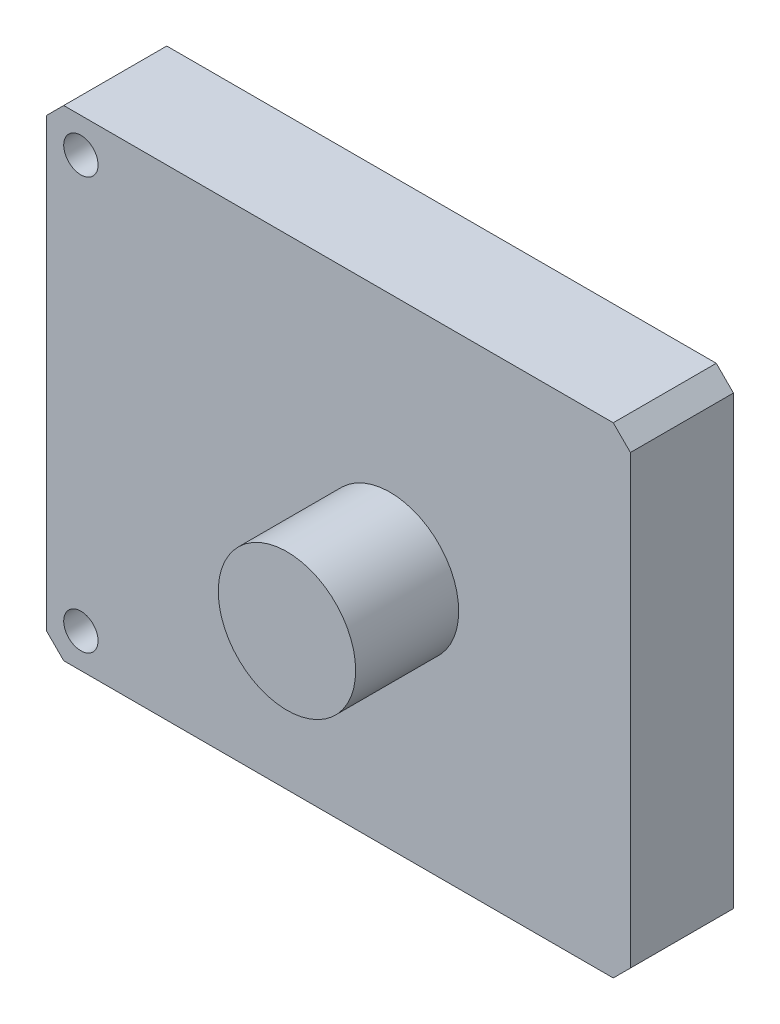
ISO-10303-21;
HEADER;
FILE_DESCRIPTION(('STEP AP214'),'2;1');
FILE_NAME('part.step','',(''),(''),'','','');
FILE_SCHEMA(('AUTOMOTIVE_DESIGN { 1 0 10303 214 1 1 1 1 }'));
ENDSEC;
DATA;
#1=APPLICATION_CONTEXT('core data for automotive mechanical design processes');
#2=APPLICATION_PROTOCOL_DEFINITION('international standard','automotive_design',2000,#1);
#3=PRODUCT_CONTEXT('',#1,'mechanical');
#4=PRODUCT('Part','Part','',(#3));
#5=PRODUCT_RELATED_PRODUCT_CATEGORY('part','',(#4));
#6=PRODUCT_DEFINITION_FORMATION('','',#4);
#7=PRODUCT_DEFINITION_CONTEXT('part definition',#1,'design');
#8=PRODUCT_DEFINITION('design','',#6,#7);
#9=PRODUCT_DEFINITION_SHAPE('','',#8);
#10=(LENGTH_UNIT() NAMED_UNIT(*) SI_UNIT(.MILLI.,.METRE.));
#11=(NAMED_UNIT(*) PLANE_ANGLE_UNIT() SI_UNIT($,.RADIAN.));
#12=(NAMED_UNIT(*) SI_UNIT($,.STERADIAN.) SOLID_ANGLE_UNIT());
#13=UNCERTAINTY_MEASURE_WITH_UNIT(LENGTH_MEASURE(1.E-05),#10,'distance_accuracy_value','');
#14=(GEOMETRIC_REPRESENTATION_CONTEXT(3) GLOBAL_UNCERTAINTY_ASSIGNED_CONTEXT((#13)) GLOBAL_UNIT_ASSIGNED_CONTEXT((#10,
#11,#12)) REPRESENTATION_CONTEXT('',''));
#15=CARTESIAN_POINT('',(0.,0.,0.));
#16=DIRECTION('',(0.,0.,1.));
#17=DIRECTION('',(1.,0.,0.));
#18=AXIS2_PLACEMENT_3D('',#15,#16,#17);
#19=CARTESIAN_POINT('',(0.,0.,30.));
#20=DIRECTION('',(0.,0.,1.));
#21=DIRECTION('',(1.,0.,0.));
#22=AXIS2_PLACEMENT_3D('',#19,#20,#21);
#23=PLANE('',#22);
#24=CARTESIAN_POINT('',(-75.,-60.,30.));
#25=DIRECTION('',(0.,0.,1.));
#26=DIRECTION('',(1.,0.,0.));
#27=AXIS2_PLACEMENT_3D('',#24,#25,#26);
#28=CIRCLE('',#27,5.00000000000001);
#29=CARTESIAN_POINT('',(-70.,-60.,30.));
#30=VERTEX_POINT('',#29);
#31=EDGE_CURVE('E191',#30,#30,#28,.F.);
#32=ORIENTED_EDGE('',*,*,#31,.T.);
#33=EDGE_LOOP('',(#32));
#34=FACE_BOUND('',#33,.T.);
#35=CARTESIAN_POINT('',(15.,0.,30.));
#36=DIRECTION('',(0.,0.,1.));
#37=DIRECTION('',(1.,0.,0.));
#38=AXIS2_PLACEMENT_3D('',#35,#36,#37);
#39=CIRCLE('',#38,20.);
#40=CARTESIAN_POINT('',(35.,0.,30.));
#41=VERTEX_POINT('',#40);
#42=EDGE_CURVE('E182',#41,#41,#39,.T.);
#43=ORIENTED_EDGE('',*,*,#42,.F.);
#44=EDGE_LOOP('',(#43));
#45=FACE_BOUND('',#44,.T.);
#46=DIRECTION('',(-1.,0.,0.));
#47=VECTOR('',#46,1.);
#48=CARTESIAN_POINT('',(-85.,70.,30.));
#49=LINE('',#48,#47);
#50=CARTESIAN_POINT('',(80.,70.,30.));
#51=VERTEX_POINT('',#50);
#52=CARTESIAN_POINT('',(-80.,70.,30.));
#53=VERTEX_POINT('',#52);
#54=EDGE_CURVE('E175',#51,#53,#49,.T.);
#55=ORIENTED_EDGE('',*,*,#54,.T.);
#56=DIRECTION('',(0.707106781186548,0.707106781186548,0.));
#57=VECTOR('',#56,1.);
#58=CARTESIAN_POINT('',(-75.,75.,30.));
#59=LINE('',#58,#57);
#60=CARTESIAN_POINT('',(-85.,64.9999999999999,30.));
#61=VERTEX_POINT('',#60);
#62=EDGE_CURVE('E156',#53,#61,#59,.F.);
#63=ORIENTED_EDGE('',*,*,#62,.T.);
#64=DIRECTION('',(0.,-1.,0.));
#65=VECTOR('',#64,1.);
#66=CARTESIAN_POINT('',(-85.,70.,30.));
#67=LINE('',#66,#65);
#68=CARTESIAN_POINT('',(-85.,-65.,30.));
#69=VERTEX_POINT('',#68);
#70=EDGE_CURVE('E126',#61,#69,#67,.T.);
#71=ORIENTED_EDGE('',*,*,#70,.T.);
#72=DIRECTION('',(-0.707106781186547,0.707106781186549,0.));
#73=VECTOR('',#72,1.);
#74=CARTESIAN_POINT('',(-75.0000000000001,-74.9999999999999,30.));
#75=LINE('',#74,#73);
#76=CARTESIAN_POINT('',(-80.,-70.,30.));
#77=VERTEX_POINT('',#76);
#78=EDGE_CURVE('E62',#69,#77,#75,.F.);
#79=ORIENTED_EDGE('',*,*,#78,.T.);
#80=DIRECTION('',(1.,0.,0.));
#81=VECTOR('',#80,1.);
#82=CARTESIAN_POINT('',(-85.,-70.,30.));
#83=LINE('',#82,#81);
#84=CARTESIAN_POINT('',(80.,-70.,30.));
#85=VERTEX_POINT('',#84);
#86=EDGE_CURVE('E142',#77,#85,#83,.T.);
#87=ORIENTED_EDGE('',*,*,#86,.T.);
#88=DIRECTION('',(-0.707106781186549,-0.707106781186546,0.));
#89=VECTOR('',#88,1.);
#90=CARTESIAN_POINT('',(74.9999999999998,-75.0000000000002,30.));
#91=LINE('',#90,#89);
#92=CARTESIAN_POINT('',(85.,-65.,30.));
#93=VERTEX_POINT('',#92);
#94=EDGE_CURVE('E153',#85,#93,#91,.F.);
#95=ORIENTED_EDGE('',*,*,#94,.T.);
#96=DIRECTION('',(0.,1.,0.));
#97=VECTOR('',#96,1.);
#98=CARTESIAN_POINT('',(85.,70.,30.));
#99=LINE('',#98,#97);
#100=CARTESIAN_POINT('',(85.,64.9999999999999,30.));
#101=VERTEX_POINT('',#100);
#102=EDGE_CURVE('E136',#93,#101,#99,.T.);
#103=ORIENTED_EDGE('',*,*,#102,.T.);
#104=DIRECTION('',(0.707106781186545,-0.70710678118655,0.));
#105=VECTOR('',#104,1.);
#106=CARTESIAN_POINT('',(75.0000000000003,74.9999999999997,30.));
#107=LINE('',#106,#105);
#108=EDGE_CURVE('E151',#101,#51,#107,.F.);
#109=ORIENTED_EDGE('',*,*,#108,.T.);
#110=EDGE_LOOP('',(#55,#63,#71,#79,#87,#95,#103,#109));
#111=FACE_BOUND('',#110,.T.);
#112=CARTESIAN_POINT('',(-75.,60.,30.));
#113=DIRECTION('',(0.,0.,1.));
#114=DIRECTION('',(1.,0.,0.));
#115=AXIS2_PLACEMENT_3D('',#112,#113,#114);
#116=CIRCLE('',#115,5.00000000000001);
#117=CARTESIAN_POINT('',(-70.,60.,30.));
#118=VERTEX_POINT('',#117);
#119=EDGE_CURVE('E197',#118,#118,#116,.T.);
#120=ORIENTED_EDGE('',*,*,#119,.F.);
#121=EDGE_LOOP('',(#120));
#122=FACE_BOUND('',#121,.T.);
#123=ADVANCED_FACE('F39',(#34,#45,#111,#122),#23,.T.);
#124=CARTESIAN_POINT('',(0.,0.,0.));
#125=DIRECTION('',(0.,0.,1.));
#126=DIRECTION('',(1.,0.,0.));
#127=AXIS2_PLACEMENT_3D('',#124,#125,#126);
#128=PLANE('',#127);
#129=DIRECTION('',(0.,-1.,0.));
#130=VECTOR('',#129,1.);
#131=CARTESIAN_POINT('',(-85.,70.,0.));
#132=LINE('',#131,#130);
#133=CARTESIAN_POINT('',(-85.,64.9999999999999,0.));
#134=VERTEX_POINT('',#133);
#135=CARTESIAN_POINT('',(-85.,-65.,0.));
#136=VERTEX_POINT('',#135);
#137=EDGE_CURVE('E124',#134,#136,#132,.T.);
#138=ORIENTED_EDGE('',*,*,#137,.F.);
#139=DIRECTION('',(-0.707106781186548,-0.707106781186548,0.));
#140=VECTOR('',#139,1.);
#141=CARTESIAN_POINT('',(-85.,64.9999999999999,0.));
#142=LINE('',#141,#140);
#143=CARTESIAN_POINT('',(-80.,70.,0.));
#144=VERTEX_POINT('',#143);
#145=EDGE_CURVE('E107',#134,#144,#142,.F.);
#146=ORIENTED_EDGE('',*,*,#145,.T.);
#147=DIRECTION('',(-1.,0.,0.));
#148=VECTOR('',#147,1.);
#149=CARTESIAN_POINT('',(-85.,70.,0.));
#150=LINE('',#149,#148);
#151=CARTESIAN_POINT('',(80.,70.,0.));
#152=VERTEX_POINT('',#151);
#153=EDGE_CURVE('E134',#152,#144,#150,.T.);
#154=ORIENTED_EDGE('',*,*,#153,.F.);
#155=DIRECTION('',(-0.707106781186545,0.70710678118655,0.));
#156=VECTOR('',#155,1.);
#157=CARTESIAN_POINT('',(80.,70.,0.));
#158=LINE('',#157,#156);
#159=CARTESIAN_POINT('',(85.,64.9999999999999,0.));
#160=VERTEX_POINT('',#159);
#161=EDGE_CURVE('E127',#152,#160,#158,.F.);
#162=ORIENTED_EDGE('',*,*,#161,.T.);
#163=DIRECTION('',(0.,1.,0.));
#164=VECTOR('',#163,1.);
#165=CARTESIAN_POINT('',(85.,70.,0.));
#166=LINE('',#165,#164);
#167=CARTESIAN_POINT('',(85.,-65.,0.));
#168=VERTEX_POINT('',#167);
#169=EDGE_CURVE('E138',#168,#160,#166,.T.);
#170=ORIENTED_EDGE('',*,*,#169,.F.);
#171=DIRECTION('',(0.707106781186549,0.707106781186546,0.));
#172=VECTOR('',#171,1.);
#173=CARTESIAN_POINT('',(85.,-65.,0.));
#174=LINE('',#173,#172);
#175=CARTESIAN_POINT('',(80.,-70.,0.));
#176=VERTEX_POINT('',#175);
#177=EDGE_CURVE('E145',#168,#176,#174,.F.);
#178=ORIENTED_EDGE('',*,*,#177,.T.);
#179=DIRECTION('',(1.,0.,0.));
#180=VECTOR('',#179,1.);
#181=CARTESIAN_POINT('',(-85.,-70.,0.));
#182=LINE('',#181,#180);
#183=CARTESIAN_POINT('',(-80.,-70.,0.));
#184=VERTEX_POINT('',#183);
#185=EDGE_CURVE('E133',#184,#176,#182,.T.);
#186=ORIENTED_EDGE('',*,*,#185,.F.);
#187=DIRECTION('',(0.707106781186547,-0.707106781186549,0.));
#188=VECTOR('',#187,1.);
#189=CARTESIAN_POINT('',(-80.,-70.,0.));
#190=LINE('',#189,#188);
#191=EDGE_CURVE('E118',#184,#136,#190,.F.);
#192=ORIENTED_EDGE('',*,*,#191,.T.);
#193=EDGE_LOOP('',(#138,#146,#154,#162,#170,#178,#186,#192));
#194=FACE_BOUND('',#193,.T.);
#195=CARTESIAN_POINT('',(-75.,-60.,0.));
#196=DIRECTION('',(0.,0.,1.));
#197=DIRECTION('',(1.,0.,0.));
#198=AXIS2_PLACEMENT_3D('',#195,#196,#197);
#199=CIRCLE('',#198,5.00000000000001);
#200=CARTESIAN_POINT('',(-70.,-60.,0.));
#201=VERTEX_POINT('',#200);
#202=EDGE_CURVE('E194',#201,#201,#199,.F.);
#203=ORIENTED_EDGE('',*,*,#202,.F.);
#204=EDGE_LOOP('',(#203));
#205=FACE_BOUND('',#204,.T.);
#206=CARTESIAN_POINT('',(-75.,60.,0.));
#207=DIRECTION('',(0.,0.,1.));
#208=DIRECTION('',(1.,0.,0.));
#209=AXIS2_PLACEMENT_3D('',#206,#207,#208);
#210=CIRCLE('',#209,5.00000000000001);
#211=CARTESIAN_POINT('',(-70.,60.,0.));
#212=VERTEX_POINT('',#211);
#213=EDGE_CURVE('E189',#212,#212,#210,.T.);
#214=ORIENTED_EDGE('',*,*,#213,.T.);
#215=EDGE_LOOP('',(#214));
#216=FACE_BOUND('',#215,.T.);
#217=ADVANCED_FACE('F130',(#194,#205,#216),#128,.F.);
#218=CARTESIAN_POINT('',(85.,70.,30.));
#219=DIRECTION('',(-1.,0.,0.));
#220=DIRECTION('',(0.,0.,1.));
#221=AXIS2_PLACEMENT_3D('',#218,#219,#220);
#222=PLANE('',#221);
#223=ORIENTED_EDGE('',*,*,#102,.F.);
#224=DIRECTION('',(0.,0.,-1.));
#225=VECTOR('',#224,1.);
#226=CARTESIAN_POINT('',(85.,-65.,30.));
#227=LINE('',#226,#225);
#228=EDGE_CURVE('E11',#93,#168,#227,.T.);
#229=ORIENTED_EDGE('',*,*,#228,.T.);
#230=ORIENTED_EDGE('',*,*,#169,.T.);
#231=DIRECTION('',(0.,0.,1.));
#232=VECTOR('',#231,1.);
#233=CARTESIAN_POINT('',(85.,64.9999999999999,30.));
#234=LINE('',#233,#232);
#235=EDGE_CURVE('E48',#160,#101,#234,.T.);
#236=ORIENTED_EDGE('',*,*,#235,.T.);
#237=EDGE_LOOP('',(#223,#229,#230,#236));
#238=FACE_BOUND('',#237,.T.);
#239=ADVANCED_FACE('F166',(#238),#222,.F.);
#240=CARTESIAN_POINT('',(-85.,70.,30.));
#241=DIRECTION('',(0.,-1.,0.));
#242=DIRECTION('',(1.,0.,0.));
#243=AXIS2_PLACEMENT_3D('',#240,#241,#242);
#244=PLANE('',#243);
#245=ORIENTED_EDGE('',*,*,#153,.T.);
#246=DIRECTION('',(0.,0.,1.));
#247=VECTOR('',#246,1.);
#248=CARTESIAN_POINT('',(-80.,70.,30.));
#249=LINE('',#248,#247);
#250=EDGE_CURVE('E112',#144,#53,#249,.T.);
#251=ORIENTED_EDGE('',*,*,#250,.T.);
#252=ORIENTED_EDGE('',*,*,#54,.F.);
#253=DIRECTION('',(0.,0.,-1.));
#254=VECTOR('',#253,1.);
#255=CARTESIAN_POINT('',(80.,70.,30.));
#256=LINE('',#255,#254);
#257=EDGE_CURVE('E117',#51,#152,#256,.T.);
#258=ORIENTED_EDGE('',*,*,#257,.T.);
#259=EDGE_LOOP('',(#245,#251,#252,#258));
#260=FACE_BOUND('',#259,.T.);
#261=ADVANCED_FACE('F179',(#260),#244,.F.);
#262=CARTESIAN_POINT('',(-85.,70.,30.));
#263=DIRECTION('',(1.,0.,0.));
#264=DIRECTION('',(0.,1.,0.));
#265=AXIS2_PLACEMENT_3D('',#262,#263,#264);
#266=PLANE('',#265);
#267=ORIENTED_EDGE('',*,*,#70,.F.);
#268=DIRECTION('',(0.,0.,-1.));
#269=VECTOR('',#268,1.);
#270=CARTESIAN_POINT('',(-85.,64.9999999999999,30.));
#271=LINE('',#270,#269);
#272=EDGE_CURVE('E111',#61,#134,#271,.T.);
#273=ORIENTED_EDGE('',*,*,#272,.T.);
#274=ORIENTED_EDGE('',*,*,#137,.T.);
#275=DIRECTION('',(0.,0.,1.));
#276=VECTOR('',#275,1.);
#277=CARTESIAN_POINT('',(-85.,-65.,30.));
#278=LINE('',#277,#276);
#279=EDGE_CURVE('E128',#136,#69,#278,.T.);
#280=ORIENTED_EDGE('',*,*,#279,.T.);
#281=EDGE_LOOP('',(#267,#273,#274,#280));
#282=FACE_BOUND('',#281,.T.);
#283=ADVANCED_FACE('F123',(#282),#266,.F.);
#284=CARTESIAN_POINT('',(-85.,-70.,30.));
#285=DIRECTION('',(0.,1.,0.));
#286=DIRECTION('',(0.,0.,1.));
#287=AXIS2_PLACEMENT_3D('',#284,#285,#286);
#288=PLANE('',#287);
#289=ORIENTED_EDGE('',*,*,#86,.F.);
#290=DIRECTION('',(0.,0.,-1.));
#291=VECTOR('',#290,1.);
#292=CARTESIAN_POINT('',(-80.,-70.,30.));
#293=LINE('',#292,#291);
#294=EDGE_CURVE('E159',#77,#184,#293,.T.);
#295=ORIENTED_EDGE('',*,*,#294,.T.);
#296=ORIENTED_EDGE('',*,*,#185,.T.);
#297=DIRECTION('',(0.,0.,1.));
#298=VECTOR('',#297,1.);
#299=CARTESIAN_POINT('',(80.,-70.,30.));
#300=LINE('',#299,#298);
#301=EDGE_CURVE('E55',#176,#85,#300,.T.);
#302=ORIENTED_EDGE('',*,*,#301,.T.);
#303=EDGE_LOOP('',(#289,#295,#296,#302));
#304=FACE_BOUND('',#303,.T.);
#305=ADVANCED_FACE('F222',(#304),#288,.F.);
#306=CARTESIAN_POINT('',(-85.,64.9999999999999,30.));
#307=DIRECTION('',(0.707106781186547,-0.707106781186547,0.));
#308=DIRECTION('',(0.,0.,-1.));
#309=AXIS2_PLACEMENT_3D('',#306,#307,#308);
#310=PLANE('',#309);
#311=ORIENTED_EDGE('',*,*,#62,.F.);
#312=ORIENTED_EDGE('',*,*,#250,.F.);
#313=ORIENTED_EDGE('',*,*,#145,.F.);
#314=ORIENTED_EDGE('',*,*,#272,.F.);
#315=EDGE_LOOP('',(#311,#312,#313,#314));
#316=FACE_BOUND('',#315,.T.);
#317=ADVANCED_FACE('F110',(#316),#310,.F.);
#318=CARTESIAN_POINT('',(-80.,-70.,30.));
#319=DIRECTION('',(0.707106781186549,0.707106781186547,0.));
#320=DIRECTION('',(0.,0.,-1.));
#321=AXIS2_PLACEMENT_3D('',#318,#319,#320);
#322=PLANE('',#321);
#323=ORIENTED_EDGE('',*,*,#78,.F.);
#324=ORIENTED_EDGE('',*,*,#279,.F.);
#325=ORIENTED_EDGE('',*,*,#191,.F.);
#326=ORIENTED_EDGE('',*,*,#294,.F.);
#327=EDGE_LOOP('',(#323,#324,#325,#326));
#328=FACE_BOUND('',#327,.T.);
#329=ADVANCED_FACE('F237',(#328),#322,.F.);
#330=CARTESIAN_POINT('',(85.,-65.,30.));
#331=DIRECTION('',(-0.707106781186546,0.707106781186549,0.));
#332=DIRECTION('',(0.,0.,-1.));
#333=AXIS2_PLACEMENT_3D('',#330,#331,#332);
#334=PLANE('',#333);
#335=ORIENTED_EDGE('',*,*,#94,.F.);
#336=ORIENTED_EDGE('',*,*,#301,.F.);
#337=ORIENTED_EDGE('',*,*,#177,.F.);
#338=ORIENTED_EDGE('',*,*,#228,.F.);
#339=EDGE_LOOP('',(#335,#336,#337,#338));
#340=FACE_BOUND('',#339,.T.);
#341=ADVANCED_FACE('F242',(#340),#334,.F.);
#342=CARTESIAN_POINT('',(80.,70.,30.));
#343=DIRECTION('',(-0.70710678118655,-0.707106781186545,0.));
#344=DIRECTION('',(0.,0.,-1.));
#345=AXIS2_PLACEMENT_3D('',#342,#343,#344);
#346=PLANE('',#345);
#347=ORIENTED_EDGE('',*,*,#108,.F.);
#348=ORIENTED_EDGE('',*,*,#235,.F.);
#349=ORIENTED_EDGE('',*,*,#161,.F.);
#350=ORIENTED_EDGE('',*,*,#257,.F.);
#351=EDGE_LOOP('',(#347,#348,#349,#350));
#352=FACE_BOUND('',#351,.T.);
#353=ADVANCED_FACE('F42',(#352),#346,.F.);
#354=CARTESIAN_POINT('',(15.,0.,60.));
#355=DIRECTION('',(0.,0.,-1.));
#356=DIRECTION('',(-1.,0.,0.));
#357=AXIS2_PLACEMENT_3D('',#354,#355,#356);
#358=CYLINDRICAL_SURFACE('',#357,20.);
#359=CARTESIAN_POINT('',(15.,0.,60.));
#360=DIRECTION('',(0.,0.,1.));
#361=DIRECTION('',(1.,0.,0.));
#362=AXIS2_PLACEMENT_3D('',#359,#360,#361);
#363=CIRCLE('',#362,20.);
#364=CARTESIAN_POINT('',(35.,0.,60.));
#365=VERTEX_POINT('',#364);
#366=EDGE_CURVE('E180',#365,#365,#363,.T.);
#367=ORIENTED_EDGE('',*,*,#366,.F.);
#368=EDGE_LOOP('',(#367));
#369=FACE_BOUND('',#368,.T.);
#370=ORIENTED_EDGE('',*,*,#42,.T.);
#371=EDGE_LOOP('',(#370));
#372=FACE_BOUND('',#371,.T.);
#373=ADVANCED_FACE('F219',(#369,#372),#358,.T.);
#374=CARTESIAN_POINT('',(0.,0.,60.));
#375=DIRECTION('',(0.,0.,1.));
#376=DIRECTION('',(1.,0.,0.));
#377=AXIS2_PLACEMENT_3D('',#374,#375,#376);
#378=PLANE('',#377);
#379=ORIENTED_EDGE('',*,*,#366,.T.);
#380=EDGE_LOOP('',(#379));
#381=FACE_BOUND('',#380,.T.);
#382=ADVANCED_FACE('F254',(#381),#378,.T.);
#383=CARTESIAN_POINT('',(-75.,-60.,0.));
#384=DIRECTION('',(0.,0.,1.));
#385=DIRECTION('',(1.,0.,0.));
#386=AXIS2_PLACEMENT_3D('',#383,#384,#385);
#387=CYLINDRICAL_SURFACE('',#386,5.00000000000001);
#388=ORIENTED_EDGE('',*,*,#202,.T.);
#389=EDGE_LOOP('',(#388));
#390=FACE_BOUND('',#389,.T.);
#391=ORIENTED_EDGE('',*,*,#31,.F.);
#392=EDGE_LOOP('',(#391));
#393=FACE_BOUND('',#392,.T.);
#394=ADVANCED_FACE('F207',(#390,#393),#387,.F.);
#395=CARTESIAN_POINT('',(-75.,60.,0.));
#396=DIRECTION('',(0.,0.,1.));
#397=DIRECTION('',(1.,0.,0.));
#398=AXIS2_PLACEMENT_3D('',#395,#396,#397);
#399=CYLINDRICAL_SURFACE('',#398,5.00000000000001);
#400=ORIENTED_EDGE('',*,*,#213,.F.);
#401=EDGE_LOOP('',(#400));
#402=FACE_BOUND('',#401,.T.);
#403=ORIENTED_EDGE('',*,*,#119,.T.);
#404=EDGE_LOOP('',(#403));
#405=FACE_BOUND('',#404,.T.);
#406=ADVANCED_FACE('F204',(#402,#405),#399,.F.);
#407=CLOSED_SHELL('',(#123,#217,#239,#261,#283,#305,#317,#329,#341,#353,#373,#382,#394,#406));
#408=MANIFOLD_SOLID_BREP('B2',#407);
#409=ADVANCED_BREP_SHAPE_REPRESENTATION('',(#18,#408),#14);
#410=SHAPE_DEFINITION_REPRESENTATION(#9,#409);
ENDSEC;
END-ISO-10303-21;
